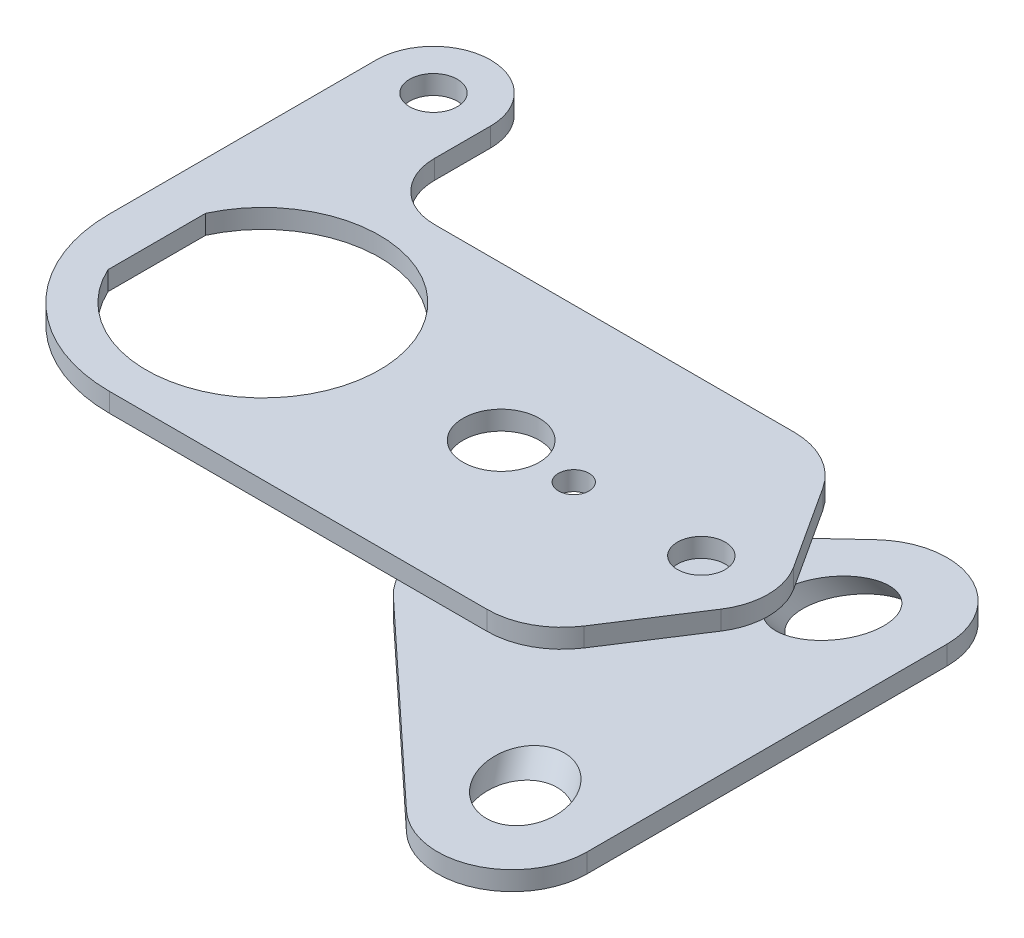
ISO-10303-21;
HEADER;
FILE_DESCRIPTION(('STEP AP214'),'2;1');
FILE_NAME('part.step','',(''),(''),'','','');
FILE_SCHEMA(('AUTOMOTIVE_DESIGN { 1 0 10303 214 1 1 1 1 }'));
ENDSEC;
DATA;
#1=APPLICATION_CONTEXT('core data for automotive mechanical design processes');
#2=APPLICATION_PROTOCOL_DEFINITION('international standard','automotive_design',2000,#1);
#3=PRODUCT_CONTEXT('',#1,'mechanical');
#4=PRODUCT('Part','Part','',(#3));
#5=PRODUCT_RELATED_PRODUCT_CATEGORY('part','',(#4));
#6=PRODUCT_DEFINITION_FORMATION('','',#4);
#7=PRODUCT_DEFINITION_CONTEXT('part definition',#1,'design');
#8=PRODUCT_DEFINITION('design','',#6,#7);
#9=PRODUCT_DEFINITION_SHAPE('','',#8);
#10=(LENGTH_UNIT() NAMED_UNIT(*) SI_UNIT(.MILLI.,.METRE.));
#11=(NAMED_UNIT(*) PLANE_ANGLE_UNIT() SI_UNIT($,.RADIAN.));
#12=(NAMED_UNIT(*) SI_UNIT($,.STERADIAN.) SOLID_ANGLE_UNIT());
#13=UNCERTAINTY_MEASURE_WITH_UNIT(LENGTH_MEASURE(1.E-05),#10,'distance_accuracy_value','');
#14=(GEOMETRIC_REPRESENTATION_CONTEXT(3) GLOBAL_UNCERTAINTY_ASSIGNED_CONTEXT((#13)) GLOBAL_UNIT_ASSIGNED_CONTEXT((#10,
#11,#12)) REPRESENTATION_CONTEXT('',''));
#15=CARTESIAN_POINT('',(0.,0.,0.));
#16=DIRECTION('',(0.,0.,1.));
#17=DIRECTION('',(1.,0.,0.));
#18=AXIS2_PLACEMENT_3D('',#15,#16,#17);
#19=CARTESIAN_POINT('',(0.,-22.225,0.));
#20=DIRECTION('',(0.,-1.,0.));
#21=DIRECTION('',(0.,0.,-1.));
#22=AXIS2_PLACEMENT_3D('',#19,#20,#21);
#23=PLANE('',#22);
#24=CARTESIAN_POINT('',(12.0901905923452,-22.225,0.));
#25=DIRECTION('',(0.,1.,0.));
#26=DIRECTION('',(0.,0.,1.));
#27=AXIS2_PLACEMENT_3D('',#24,#25,#26);
#28=CIRCLE('',#27,2.55269999999999);
#29=CARTESIAN_POINT('',(12.0901905923452,-22.225,2.55269999999999));
#30=VERTEX_POINT('',#29);
#31=EDGE_CURVE('E213',#30,#30,#28,.T.);
#32=ORIENTED_EDGE('',*,*,#31,.T.);
#33=EDGE_LOOP('',(#32));
#34=FACE_BOUND('',#33,.T.);
#35=CARTESIAN_POINT('',(30.8214622641509,-22.225,27.9909198113208));
#36=DIRECTION('',(0.,-1.,0.));
#37=DIRECTION('',(-0.453842868921282,0.,-0.891081730443005));
#38=AXIS2_PLACEMENT_3D('',#35,#36,#37);
#39=ELLIPSE('',#38,8.34330157224348,6.35);
#40=CARTESIAN_POINT('',(27.0349143423285,-22.225,20.5563562087182));
#41=VERTEX_POINT('',#40);
#42=EDGE_CURVE('E13',#41,#41,#39,.T.);
#43=ORIENTED_EDGE('',*,*,#42,.F.);
#44=EDGE_LOOP('',(#43));
#45=FACE_BOUND('',#44,.T.);
#46=CARTESIAN_POINT('',(30.8214622641509,-22.225,-27.9909198113208));
#47=DIRECTION('',(0.,1.,0.));
#48=DIRECTION('',(-0.453842868921282,0.,0.891081730443005));
#49=AXIS2_PLACEMENT_3D('',#46,#47,#48);
#50=ELLIPSE('',#49,8.34330157224348,6.35);
#51=CARTESIAN_POINT('',(27.0349143423285,-22.225,-20.5563562087182));
#52=VERTEX_POINT('',#51);
#53=EDGE_CURVE('E146',#52,#52,#50,.T.);
#54=ORIENTED_EDGE('',*,*,#53,.T.);
#55=EDGE_LOOP('',(#54));
#56=FACE_BOUND('',#55,.T.);
#57=CARTESIAN_POINT('',(0.,-22.225,0.));
#58=DIRECTION('',(0.,-1.,0.));
#59=DIRECTION('',(0.,0.,-1.));
#60=AXIS2_PLACEMENT_3D('',#57,#58,#59);
#61=CIRCLE('',#60,6.35);
#62=CARTESIAN_POINT('',(0.,-22.225,-6.35));
#63=VERTEX_POINT('',#62);
#64=EDGE_CURVE('E115',#63,#63,#61,.T.);
#65=ORIENTED_EDGE('',*,*,#64,.F.);
#66=EDGE_LOOP('',(#65));
#67=FACE_BOUND('',#66,.T.);
#68=DIRECTION('',(0.731631898404247,0.,-0.681699908491557));
#69=VECTOR('',#68,1.);
#70=CARTESIAN_POINT('',(-8.65758883784278,-22.225,-9.29172510973394));
#71=LINE('',#70,#69);
#72=CARTESIAN_POINT('',(-8.65758883784278,-22.225,-9.29172510973394));
#73=VERTEX_POINT('',#72);
#74=CARTESIAN_POINT('',(23.3291311537776,-22.225,-39.0954339676884));
#75=VERTEX_POINT('',#74);
#76=EDGE_CURVE('E198',#73,#75,#71,.T.);
#77=ORIENTED_EDGE('',*,*,#76,.T.);
#78=CARTESIAN_POINT('',(31.8302668874597,-22.225,-29.9716215717197));
#79=DIRECTION('',(0.,-1.,0.));
#80=DIRECTION('',(0.,0.,-1.));
#81=AXIS2_PLACEMENT_3D('',#78,#79,#80);
#82=CIRCLE('',#81,12.4704956356722);
#83=CARTESIAN_POINT('',(44.3007625231319,-22.225,-29.9716215717197));
#84=VERTEX_POINT('',#83);
#85=EDGE_CURVE('E66',#75,#84,#82,.T.);
#86=ORIENTED_EDGE('',*,*,#85,.T.);
#87=DIRECTION('',(0.,0.,-1.));
#88=VECTOR('',#87,1.);
#89=CARTESIAN_POINT('',(44.3007625231319,-22.225,0.));
#90=LINE('',#89,#88);
#91=CARTESIAN_POINT('',(44.3007625231319,-22.225,29.9716215717197));
#92=VERTEX_POINT('',#91);
#93=EDGE_CURVE('E116',#92,#84,#90,.T.);
#94=ORIENTED_EDGE('',*,*,#93,.F.);
#95=CARTESIAN_POINT('',(31.8302668874597,-22.225,29.9716215717197));
#96=DIRECTION('',(0.,-1.,0.));
#97=DIRECTION('',(0.,0.,-1.));
#98=AXIS2_PLACEMENT_3D('',#95,#96,#97);
#99=CIRCLE('',#98,12.4704956356722);
#100=CARTESIAN_POINT('',(23.3291311537776,-22.225,39.0954339676884));
#101=VERTEX_POINT('',#100);
#102=EDGE_CURVE('E123',#92,#101,#99,.T.);
#103=ORIENTED_EDGE('',*,*,#102,.T.);
#104=DIRECTION('',(-0.731631898404247,0.,-0.681699908491558));
#105=VECTOR('',#104,1.);
#106=CARTESIAN_POINT('',(-8.65758883784278,-22.225,9.29172510973393));
#107=LINE('',#106,#105);
#108=CARTESIAN_POINT('',(-8.65758883784278,-22.225,9.29172510973393));
#109=VERTEX_POINT('',#108);
#110=EDGE_CURVE('E138',#101,#109,#107,.T.);
#111=ORIENTED_EDGE('',*,*,#110,.T.);
#112=CARTESIAN_POINT('',(0.,-22.225,0.));
#113=DIRECTION('',(0.,-1.,0.));
#114=DIRECTION('',(0.,0.,-1.));
#115=AXIS2_PLACEMENT_3D('',#112,#113,#114);
#116=CIRCLE('',#115,12.7);
#117=EDGE_CURVE('E142',#109,#73,#116,.T.);
#118=ORIENTED_EDGE('',*,*,#117,.T.);
#119=EDGE_LOOP('',(#77,#86,#94,#103,#111,#118));
#120=FACE_BOUND('',#119,.T.);
#121=ADVANCED_FACE('F49',(#34,#45,#56,#67,#120),#23,.T.);
#122=CARTESIAN_POINT('',(0.,-19.05,0.));
#123=DIRECTION('',(0.,-1.,0.));
#124=DIRECTION('',(0.,0.,-1.));
#125=AXIS2_PLACEMENT_3D('',#122,#123,#124);
#126=PLANE('',#125);
#127=CARTESIAN_POINT('',(12.0901905923452,-19.05,0.));
#128=DIRECTION('',(0.,-1.,0.));
#129=DIRECTION('',(0.,0.,-1.));
#130=AXIS2_PLACEMENT_3D('',#127,#128,#129);
#131=CIRCLE('',#130,2.5527);
#132=CARTESIAN_POINT('',(12.0901905923452,-19.05,-2.5527));
#133=VERTEX_POINT('',#132);
#134=EDGE_CURVE('E53',#133,#133,#131,.T.);
#135=ORIENTED_EDGE('',*,*,#134,.T.);
#136=EDGE_LOOP('',(#135));
#137=FACE_BOUND('',#136,.T.);
#138=CARTESIAN_POINT('',(29.5933962264151,-19.05,25.5797169811321));
#139=DIRECTION('',(0.,-1.,0.));
#140=DIRECTION('',(-0.453842868921282,0.,-0.891081730443005));
#141=AXIS2_PLACEMENT_3D('',#138,#139,#140);
#142=ELLIPSE('',#141,8.34330157224348,6.35);
#143=CARTESIAN_POINT('',(25.8068483045927,-19.05,18.1451533785295));
#144=VERTEX_POINT('',#143);
#145=EDGE_CURVE('E58',#144,#144,#142,.T.);
#146=ORIENTED_EDGE('',*,*,#145,.T.);
#147=EDGE_LOOP('',(#146));
#148=FACE_BOUND('',#147,.T.);
#149=CARTESIAN_POINT('',(29.5933962264151,-19.05,-25.5797169811321));
#150=DIRECTION('',(0.,1.,0.));
#151=DIRECTION('',(-0.453842868921282,0.,0.891081730443005));
#152=AXIS2_PLACEMENT_3D('',#149,#150,#151);
#153=ELLIPSE('',#152,8.34330157224348,6.35);
#154=CARTESIAN_POINT('',(25.8068483045927,-19.05,-18.1451533785295));
#155=VERTEX_POINT('',#154);
#156=EDGE_CURVE('E149',#155,#155,#153,.T.);
#157=ORIENTED_EDGE('',*,*,#156,.F.);
#158=EDGE_LOOP('',(#157));
#159=FACE_BOUND('',#158,.T.);
#160=CARTESIAN_POINT('',(0.,-19.05,0.));
#161=DIRECTION('',(0.,-1.,0.));
#162=DIRECTION('',(0.,0.,-1.));
#163=AXIS2_PLACEMENT_3D('',#160,#161,#162);
#164=CIRCLE('',#163,6.35);
#165=CARTESIAN_POINT('',(0.,-19.05,-6.35));
#166=VERTEX_POINT('',#165);
#167=EDGE_CURVE('E145',#166,#166,#164,.T.);
#168=ORIENTED_EDGE('',*,*,#167,.T.);
#169=EDGE_LOOP('',(#168));
#170=FACE_BOUND('',#169,.T.);
#171=CARTESIAN_POINT('',(31.8302668874597,-19.05,-29.9716215717197));
#172=DIRECTION('',(0.,-1.,0.));
#173=DIRECTION('',(0.,0.,-1.));
#174=AXIS2_PLACEMENT_3D('',#171,#172,#173);
#175=CIRCLE('',#174,12.4704956356722);
#176=CARTESIAN_POINT('',(44.3007625231319,-19.05,-29.9716215717197));
#177=VERTEX_POINT('',#176);
#178=CARTESIAN_POINT('',(23.3291311537776,-19.05,-39.0954339676884));
#179=VERTEX_POINT('',#178);
#180=EDGE_CURVE('E211',#177,#179,#175,.F.);
#181=ORIENTED_EDGE('',*,*,#180,.T.);
#182=DIRECTION('',(-0.731631898404247,0.,0.681699908491557));
#183=VECTOR('',#182,1.);
#184=CARTESIAN_POINT('',(-8.65758883784278,-19.05,-9.29172510973394));
#185=LINE('',#184,#183);
#186=CARTESIAN_POINT('',(-8.65758883784278,-19.05,-9.29172510973394));
#187=VERTEX_POINT('',#186);
#188=EDGE_CURVE('E139',#179,#187,#185,.T.);
#189=ORIENTED_EDGE('',*,*,#188,.T.);
#190=CARTESIAN_POINT('',(0.,-19.05,0.));
#191=DIRECTION('',(0.,-1.,0.));
#192=DIRECTION('',(0.,0.,-1.));
#193=AXIS2_PLACEMENT_3D('',#190,#191,#192);
#194=CIRCLE('',#193,12.7);
#195=CARTESIAN_POINT('',(-8.65758883784278,-19.05,9.29172510973393));
#196=VERTEX_POINT('',#195);
#197=EDGE_CURVE('E135',#187,#196,#194,.F.);
#198=ORIENTED_EDGE('',*,*,#197,.T.);
#199=DIRECTION('',(0.731631898404247,0.,0.681699908491558));
#200=VECTOR('',#199,1.);
#201=CARTESIAN_POINT('',(-8.65758883784278,-19.05,9.29172510973393));
#202=LINE('',#201,#200);
#203=CARTESIAN_POINT('',(23.3291311537776,-19.05,39.0954339676884));
#204=VERTEX_POINT('',#203);
#205=EDGE_CURVE('E128',#196,#204,#202,.T.);
#206=ORIENTED_EDGE('',*,*,#205,.T.);
#207=CARTESIAN_POINT('',(31.8302668874597,-19.05,29.9716215717197));
#208=DIRECTION('',(0.,-1.,0.));
#209=DIRECTION('',(0.,0.,-1.));
#210=AXIS2_PLACEMENT_3D('',#207,#208,#209);
#211=CIRCLE('',#210,12.4704956356722);
#212=CARTESIAN_POINT('',(44.3007625231319,-19.05,29.9716215717197));
#213=VERTEX_POINT('',#212);
#214=EDGE_CURVE('E120',#204,#213,#211,.F.);
#215=ORIENTED_EDGE('',*,*,#214,.T.);
#216=DIRECTION('',(0.,0.,1.));
#217=VECTOR('',#216,1.);
#218=CARTESIAN_POINT('',(44.3007625231319,-19.05,0.));
#219=LINE('',#218,#217);
#220=EDGE_CURVE('E105',#177,#213,#219,.T.);
#221=ORIENTED_EDGE('',*,*,#220,.F.);
#222=EDGE_LOOP('',(#181,#189,#198,#206,#215,#221));
#223=FACE_BOUND('',#222,.T.);
#224=ADVANCED_FACE('F51',(#137,#148,#159,#170,#223),#126,.F.);
#225=CARTESIAN_POINT('',(36.7090218974339,-37.4464956372682,39.5506405547178));
#226=DIRECTION('',(-0.294383710597585,0.761089593252292,-0.577997285441599));
#227=DIRECTION('',(0.,0.604797490267115,0.796379303954214));
#228=AXIS2_PLACEMENT_3D('',#225,#226,#227);
#229=CYLINDRICAL_SURFACE('',#228,6.35);
#230=ORIENTED_EDGE('',*,*,#42,.T.);
#231=EDGE_LOOP('',(#230));
#232=FACE_BOUND('',#231,.T.);
#233=ORIENTED_EDGE('',*,*,#145,.F.);
#234=EDGE_LOOP('',(#233));
#235=FACE_BOUND('',#234,.T.);
#236=ADVANCED_FACE('F168',(#232,#235),#229,.F.);
#237=CARTESIAN_POINT('',(36.7090218974339,-37.4464956372682,-39.5506405547178));
#238=DIRECTION('',(-0.294383710597585,0.761089593252292,0.577997285441599));
#239=DIRECTION('',(0.,0.604797490267115,-0.796379303954214));
#240=AXIS2_PLACEMENT_3D('',#237,#238,#239);
#241=CYLINDRICAL_SURFACE('',#240,6.35);
#242=ORIENTED_EDGE('',*,*,#53,.F.);
#243=EDGE_LOOP('',(#242));
#244=FACE_BOUND('',#243,.T.);
#245=ORIENTED_EDGE('',*,*,#156,.T.);
#246=EDGE_LOOP('',(#245));
#247=FACE_BOUND('',#246,.T.);
#248=ADVANCED_FACE('F160',(#244,#247),#241,.F.);
#249=CARTESIAN_POINT('',(0.,24.3105122421383,0.));
#250=DIRECTION('',(0.,-1.,0.));
#251=DIRECTION('',(0.,0.,-1.));
#252=AXIS2_PLACEMENT_3D('',#249,#250,#251);
#253=CYLINDRICAL_SURFACE('',#252,6.35);
#254=ORIENTED_EDGE('',*,*,#64,.T.);
#255=EDGE_LOOP('',(#254));
#256=FACE_BOUND('',#255,.T.);
#257=ORIENTED_EDGE('',*,*,#167,.F.);
#258=EDGE_LOOP('',(#257));
#259=FACE_BOUND('',#258,.T.);
#260=ADVANCED_FACE('F157',(#256,#259),#253,.F.);
#261=CARTESIAN_POINT('',(31.8302668874597,104.244697777317,-29.9716215717197));
#262=DIRECTION('',(0.,-1.,0.));
#263=DIRECTION('',(0.,0.,-1.));
#264=AXIS2_PLACEMENT_3D('',#261,#262,#263);
#265=CYLINDRICAL_SURFACE('',#264,12.4704956356722);
#266=DIRECTION('',(0.,-1.,0.));
#267=VECTOR('',#266,1.);
#268=CARTESIAN_POINT('',(44.3007625231319,104.244697777317,-29.9716215717197));
#269=LINE('',#268,#267);
#270=EDGE_CURVE('E111',#177,#84,#269,.T.);
#271=ORIENTED_EDGE('',*,*,#270,.T.);
#272=ORIENTED_EDGE('',*,*,#85,.F.);
#273=DIRECTION('',(0.,-1.,0.));
#274=VECTOR('',#273,1.);
#275=CARTESIAN_POINT('',(23.3291311537776,104.244697777317,-39.0954339676884));
#276=LINE('',#275,#274);
#277=EDGE_CURVE('E207',#179,#75,#276,.T.);
#278=ORIENTED_EDGE('',*,*,#277,.F.);
#279=ORIENTED_EDGE('',*,*,#180,.F.);
#280=EDGE_LOOP('',(#271,#272,#278,#279));
#281=FACE_BOUND('',#280,.T.);
#282=ADVANCED_FACE('F159',(#281),#265,.T.);
#283=CARTESIAN_POINT('',(44.3007625231319,104.244697777317,0.));
#284=DIRECTION('',(-1.,0.,0.));
#285=DIRECTION('',(0.,0.,1.));
#286=AXIS2_PLACEMENT_3D('',#283,#284,#285);
#287=PLANE('',#286);
#288=ORIENTED_EDGE('',*,*,#220,.T.);
#289=DIRECTION('',(0.,-1.,0.));
#290=VECTOR('',#289,1.);
#291=CARTESIAN_POINT('',(44.3007625231319,104.244697777317,29.9716215717197));
#292=LINE('',#291,#290);
#293=EDGE_CURVE('E109',#213,#92,#292,.T.);
#294=ORIENTED_EDGE('',*,*,#293,.T.);
#295=ORIENTED_EDGE('',*,*,#93,.T.);
#296=ORIENTED_EDGE('',*,*,#270,.F.);
#297=EDGE_LOOP('',(#288,#294,#295,#296));
#298=FACE_BOUND('',#297,.T.);
#299=ADVANCED_FACE('F107',(#298),#287,.F.);
#300=CARTESIAN_POINT('',(31.8302668874597,104.244697777317,29.9716215717197));
#301=DIRECTION('',(0.,-1.,0.));
#302=DIRECTION('',(0.,0.,-1.));
#303=AXIS2_PLACEMENT_3D('',#300,#301,#302);
#304=CYLINDRICAL_SURFACE('',#303,12.4704956356722);
#305=DIRECTION('',(0.,-1.,0.));
#306=VECTOR('',#305,1.);
#307=CARTESIAN_POINT('',(23.3291311537776,104.244697777317,39.0954339676884));
#308=LINE('',#307,#306);
#309=EDGE_CURVE('E134',#204,#101,#308,.T.);
#310=ORIENTED_EDGE('',*,*,#309,.T.);
#311=ORIENTED_EDGE('',*,*,#102,.F.);
#312=ORIENTED_EDGE('',*,*,#293,.F.);
#313=ORIENTED_EDGE('',*,*,#214,.F.);
#314=EDGE_LOOP('',(#310,#311,#312,#313));
#315=FACE_BOUND('',#314,.T.);
#316=ADVANCED_FACE('F119',(#315),#304,.T.);
#317=CARTESIAN_POINT('',(-8.65758883784278,104.244697777317,9.29172510973393));
#318=DIRECTION('',(-0.681699908491558,0.,0.731631898404247));
#319=DIRECTION('',(0.731631898404247,0.,0.681699908491558));
#320=AXIS2_PLACEMENT_3D('',#317,#318,#319);
#321=PLANE('',#320);
#322=DIRECTION('',(0.,-1.,0.));
#323=VECTOR('',#322,1.);
#324=CARTESIAN_POINT('',(-8.65758883784278,104.244697777317,9.29172510973393));
#325=LINE('',#324,#323);
#326=EDGE_CURVE('E137',#196,#109,#325,.T.);
#327=ORIENTED_EDGE('',*,*,#326,.T.);
#328=ORIENTED_EDGE('',*,*,#110,.F.);
#329=ORIENTED_EDGE('',*,*,#309,.F.);
#330=ORIENTED_EDGE('',*,*,#205,.F.);
#331=EDGE_LOOP('',(#327,#328,#329,#330));
#332=FACE_BOUND('',#331,.T.);
#333=ADVANCED_FACE('F220',(#332),#321,.T.);
#334=CARTESIAN_POINT('',(0.,104.244697777317,0.));
#335=DIRECTION('',(0.,-1.,0.));
#336=DIRECTION('',(0.,0.,-1.));
#337=AXIS2_PLACEMENT_3D('',#334,#335,#336);
#338=CYLINDRICAL_SURFACE('',#337,12.7);
#339=DIRECTION('',(0.,-1.,0.));
#340=VECTOR('',#339,1.);
#341=CARTESIAN_POINT('',(-8.65758883784278,104.244697777317,-9.29172510973394));
#342=LINE('',#341,#340);
#343=EDGE_CURVE('E74',#187,#73,#342,.T.);
#344=ORIENTED_EDGE('',*,*,#343,.T.);
#345=ORIENTED_EDGE('',*,*,#117,.F.);
#346=ORIENTED_EDGE('',*,*,#326,.F.);
#347=ORIENTED_EDGE('',*,*,#197,.F.);
#348=EDGE_LOOP('',(#344,#345,#346,#347));
#349=FACE_BOUND('',#348,.T.);
#350=ADVANCED_FACE('F223',(#349),#338,.T.);
#351=CARTESIAN_POINT('',(-8.65758883784278,104.244697777317,-9.29172510973394));
#352=DIRECTION('',(-0.681699908491557,0.,-0.731631898404247));
#353=DIRECTION('',(-0.731631898404247,0.,0.681699908491557));
#354=AXIS2_PLACEMENT_3D('',#351,#352,#353);
#355=PLANE('',#354);
#356=ORIENTED_EDGE('',*,*,#277,.T.);
#357=ORIENTED_EDGE('',*,*,#76,.F.);
#358=ORIENTED_EDGE('',*,*,#343,.F.);
#359=ORIENTED_EDGE('',*,*,#188,.F.);
#360=EDGE_LOOP('',(#356,#357,#358,#359));
#361=FACE_BOUND('',#360,.T.);
#362=ADVANCED_FACE('F224',(#361),#355,.T.);
#363=CARTESIAN_POINT('',(12.0901905923452,3.175,0.));
#364=DIRECTION('',(0.,1.,0.));
#365=DIRECTION('',(0.,0.,1.));
#366=AXIS2_PLACEMENT_3D('',#363,#364,#365);
#367=CYLINDRICAL_SURFACE('',#366,2.5527);
#368=ORIENTED_EDGE('',*,*,#31,.F.);
#369=EDGE_LOOP('',(#368));
#370=FACE_BOUND('',#369,.T.);
#371=ORIENTED_EDGE('',*,*,#134,.F.);
#372=EDGE_LOOP('',(#371));
#373=FACE_BOUND('',#372,.T.);
#374=ADVANCED_FACE('F226',(#370,#373),#367,.F.);
#375=CLOSED_SHELL('',(#121,#224,#236,#248,#260,#282,#299,#316,#333,#350,#362,#374));
#376=MANIFOLD_SOLID_BREP('B2',#375);
#377=CARTESIAN_POINT('',(23.2338046233088,3.175,13.0932017603989));
#378=DIRECTION('',(0.,-1.,0.));
#379=DIRECTION('',(0.,0.,-1.));
#380=AXIS2_PLACEMENT_3D('',#377,#378,#379);
#381=CYLINDRICAL_SURFACE('',#380,12.4704956356722);
#382=CARTESIAN_POINT('',(23.2338046233088,0.,13.0932017603989));
#383=DIRECTION('',(0.,-1.,0.));
#384=DIRECTION('',(0.,0.,-1.));
#385=AXIS2_PLACEMENT_3D('',#382,#383,#384);
#386=CIRCLE('',#385,12.4704956356722);
#387=CARTESIAN_POINT('',(33.6987802315256,0.,19.8753508975638));
#388=VERTEX_POINT('',#387);
#389=CARTESIAN_POINT('',(23.2338046233088,0.,25.5636973960711));
#390=VERTEX_POINT('',#389);
#391=EDGE_CURVE('E342',#388,#390,#386,.T.);
#392=ORIENTED_EDGE('',*,*,#391,.F.);
#393=DIRECTION('',(0.,1.,0.));
#394=VECTOR('',#393,1.);
#395=CARTESIAN_POINT('',(33.6987802315256,-41.1789633152074,19.8753508975638));
#396=LINE('',#395,#394);
#397=CARTESIAN_POINT('',(33.6987802315256,3.175,19.8753508975638));
#398=VERTEX_POINT('',#397);
#399=EDGE_CURVE('E337',#388,#398,#396,.T.);
#400=ORIENTED_EDGE('',*,*,#399,.T.);
#401=CARTESIAN_POINT('',(23.2338046233088,3.175,13.0932017603989));
#402=DIRECTION('',(0.,-1.,0.));
#403=DIRECTION('',(0.,0.,-1.));
#404=AXIS2_PLACEMENT_3D('',#401,#402,#403);
#405=CIRCLE('',#404,12.4704956356722);
#406=CARTESIAN_POINT('',(23.2338046233088,3.175,25.5636973960711));
#407=VERTEX_POINT('',#406);
#408=EDGE_CURVE('E444',#398,#407,#405,.T.);
#409=ORIENTED_EDGE('',*,*,#408,.T.);
#410=DIRECTION('',(0.,-1.,0.));
#411=VECTOR('',#410,1.);
#412=CARTESIAN_POINT('',(23.2338046233088,3.175,25.5636973960711));
#413=LINE('',#412,#411);
#414=EDGE_CURVE('E509',#407,#390,#413,.T.);
#415=ORIENTED_EDGE('',*,*,#414,.T.);
#416=EDGE_LOOP('',(#392,#400,#409,#415));
#417=FACE_BOUND('',#416,.T.);
#418=ADVANCED_FACE('F322',(#417),#381,.T.);
#419=CARTESIAN_POINT('',(-39.6875,3.175,0.));
#420=DIRECTION('',(0.,-1.,0.));
#421=DIRECTION('',(0.,0.,-1.));
#422=AXIS2_PLACEMENT_3D('',#419,#420,#421);
#423=CYLINDRICAL_SURFACE('',#422,25.5636973960711);
#424=DIRECTION('',(0.,1.,0.));
#425=VECTOR('',#424,1.);
#426=CARTESIAN_POINT('',(-65.2511973960711,-57.2381264979908,0.));
#427=LINE('',#426,#425);
#428=CARTESIAN_POINT('',(-65.2511973960711,0.,0.));
#429=VERTEX_POINT('',#428);
#430=CARTESIAN_POINT('',(-65.2511973960711,3.175,0.));
#431=VERTEX_POINT('',#430);
#432=EDGE_CURVE('E466',#429,#431,#427,.T.);
#433=ORIENTED_EDGE('',*,*,#432,.F.);
#434=CARTESIAN_POINT('',(-39.6875,0.,0.));
#435=DIRECTION('',(0.,-1.,0.));
#436=DIRECTION('',(0.,0.,-1.));
#437=AXIS2_PLACEMENT_3D('',#434,#435,#436);
#438=CIRCLE('',#437,25.5636973960711);
#439=CARTESIAN_POINT('',(-39.6875,0.,25.5636973960711));
#440=VERTEX_POINT('',#439);
#441=EDGE_CURVE('E504',#440,#429,#438,.T.);
#442=ORIENTED_EDGE('',*,*,#441,.F.);
#443=DIRECTION('',(0.,-1.,0.));
#444=VECTOR('',#443,1.);
#445=CARTESIAN_POINT('',(-39.6875,3.175,25.5636973960711));
#446=LINE('',#445,#444);
#447=CARTESIAN_POINT('',(-39.6875,3.175,25.5636973960711));
#448=VERTEX_POINT('',#447);
#449=EDGE_CURVE('E512',#448,#440,#446,.T.);
#450=ORIENTED_EDGE('',*,*,#449,.F.);
#451=CARTESIAN_POINT('',(-39.6875,3.175,0.));
#452=DIRECTION('',(0.,-1.,0.));
#453=DIRECTION('',(0.,0.,-1.));
#454=AXIS2_PLACEMENT_3D('',#451,#452,#453);
#455=CIRCLE('',#454,25.5636973960711);
#456=EDGE_CURVE('E491',#448,#431,#455,.T.);
#457=ORIENTED_EDGE('',*,*,#456,.T.);
#458=EDGE_LOOP('',(#433,#442,#450,#457));
#459=FACE_BOUND('',#458,.T.);
#460=ADVANCED_FACE('F599',(#459),#423,.T.);
#461=CARTESIAN_POINT('',(0.,3.175,0.));
#462=DIRECTION('',(0.,1.,0.));
#463=DIRECTION('',(0.,0.,1.));
#464=AXIS2_PLACEMENT_3D('',#461,#462,#463);
#465=PLANE('',#464);
#466=ORIENTED_EDGE('',*,*,#408,.F.);
#467=DIRECTION('',(0.543855620121812,0.,-0.839178803630025));
#468=VECTOR('',#467,1.);
#469=CARTESIAN_POINT('',(33.6987802315256,3.175,19.8753508975638));
#470=LINE('',#469,#468);
#471=CARTESIAN_POINT('',(42.6628744553386,3.175,6.04359557860364));
#472=VERTEX_POINT('',#471);
#473=EDGE_CURVE('E426',#398,#472,#470,.T.);
#474=ORIENTED_EDGE('',*,*,#473,.T.);
#475=CARTESIAN_POINT('',(33.3375,3.175,0.));
#476=DIRECTION('',(0.,1.,0.));
#477=DIRECTION('',(0.,0.,1.));
#478=AXIS2_PLACEMENT_3D('',#475,#476,#477);
#479=CIRCLE('',#478,11.1125);
#480=CARTESIAN_POINT('',(42.6628744553387,3.175,-6.04359557860364));
#481=VERTEX_POINT('',#480);
#482=EDGE_CURVE('E433',#472,#481,#479,.T.);
#483=ORIENTED_EDGE('',*,*,#482,.T.);
#484=DIRECTION('',(-0.543855620121812,0.,-0.839178803630025));
#485=VECTOR('',#484,1.);
#486=CARTESIAN_POINT('',(33.6987802315256,3.175,-19.8753508975638));
#487=LINE('',#486,#485);
#488=CARTESIAN_POINT('',(33.6987802315256,3.175,-19.8753508975638));
#489=VERTEX_POINT('',#488);
#490=EDGE_CURVE('E439',#481,#489,#487,.T.);
#491=ORIENTED_EDGE('',*,*,#490,.T.);
#492=CARTESIAN_POINT('',(23.2338046233088,3.175,-13.0932017603989));
#493=DIRECTION('',(0.,-1.,0.));
#494=DIRECTION('',(0.,0.,-1.));
#495=AXIS2_PLACEMENT_3D('',#492,#493,#494);
#496=CIRCLE('',#495,12.4704956356722);
#497=CARTESIAN_POINT('',(23.2338046233088,3.175,-25.5636973960711));
#498=VERTEX_POINT('',#497);
#499=EDGE_CURVE('E485',#498,#489,#496,.T.);
#500=ORIENTED_EDGE('',*,*,#499,.F.);
#501=DIRECTION('',(-1.,0.,0.));
#502=VECTOR('',#501,1.);
#503=CARTESIAN_POINT('',(0.,3.175,-25.5636973960711));
#504=LINE('',#503,#502);
#505=CARTESIAN_POINT('',(-36.6761973960711,3.175,-25.5636973960711));
#506=VERTEX_POINT('',#505);
#507=EDGE_CURVE('E488',#498,#506,#504,.T.);
#508=ORIENTED_EDGE('',*,*,#507,.T.);
#509=CARTESIAN_POINT('',(-36.6761973960711,3.175,-35.0886973960711));
#510=DIRECTION('',(0.,1.,0.));
#511=DIRECTION('',(0.,0.,1.));
#512=AXIS2_PLACEMENT_3D('',#509,#510,#511);
#513=CIRCLE('',#512,9.525);
#514=CARTESIAN_POINT('',(-46.2011973960711,3.175,-35.0886973960711));
#515=VERTEX_POINT('',#514);
#516=EDGE_CURVE('E330',#506,#515,#513,.F.);
#517=ORIENTED_EDGE('',*,*,#516,.T.);
#518=DIRECTION('',(0.,0.,-1.));
#519=VECTOR('',#518,1.);
#520=CARTESIAN_POINT('',(-46.2011973960711,3.175,-44.45));
#521=LINE('',#520,#519);
#522=CARTESIAN_POINT('',(-46.2011973960711,3.175,-44.45));
#523=VERTEX_POINT('',#522);
#524=EDGE_CURVE('E462',#515,#523,#521,.T.);
#525=ORIENTED_EDGE('',*,*,#524,.T.);
#526=CARTESIAN_POINT('',(-55.7261973960711,3.175,-44.45));
#527=DIRECTION('',(0.,1.,0.));
#528=DIRECTION('',(0.,0.,1.));
#529=AXIS2_PLACEMENT_3D('',#526,#527,#528);
#530=CIRCLE('',#529,9.52500000000001);
#531=CARTESIAN_POINT('',(-65.2511973960711,3.175,-44.45));
#532=VERTEX_POINT('',#531);
#533=EDGE_CURVE('E470',#523,#532,#530,.T.);
#534=ORIENTED_EDGE('',*,*,#533,.T.);
#535=DIRECTION('',(0.,0.,1.));
#536=VECTOR('',#535,1.);
#537=CARTESIAN_POINT('',(-65.2511973960711,3.175,0.));
#538=LINE('',#537,#536);
#539=EDGE_CURVE('E473',#532,#431,#538,.T.);
#540=ORIENTED_EDGE('',*,*,#539,.T.);
#541=ORIENTED_EDGE('',*,*,#456,.F.);
#542=DIRECTION('',(1.,0.,0.));
#543=VECTOR('',#542,1.);
#544=CARTESIAN_POINT('',(0.,3.175,25.5636973960711));
#545=LINE('',#544,#543);
#546=EDGE_CURVE('E494',#448,#407,#545,.T.);
#547=ORIENTED_EDGE('',*,*,#546,.T.);
#548=EDGE_LOOP('',(#466,#474,#483,#491,#500,#508,#517,#525,#534,#540,#541,#547));
#549=FACE_BOUND('',#548,.T.);
#550=CARTESIAN_POINT('',(-55.7261973960711,3.175,-44.45));
#551=DIRECTION('',(0.,1.,0.));
#552=DIRECTION('',(0.,0.,1.));
#553=AXIS2_PLACEMENT_3D('',#550,#551,#552);
#554=CIRCLE('',#553,3.96875);
#555=CARTESIAN_POINT('',(-55.7261973960711,3.175,-40.48125));
#556=VERTEX_POINT('',#555);
#557=EDGE_CURVE('E456',#556,#556,#554,.T.);
#558=ORIENTED_EDGE('',*,*,#557,.F.);
#559=EDGE_LOOP('',(#558));
#560=FACE_BOUND('',#559,.T.);
#561=CARTESIAN_POINT('',(33.3375,3.175,0.));
#562=DIRECTION('',(0.,1.,0.));
#563=DIRECTION('',(0.,0.,1.));
#564=AXIS2_PLACEMENT_3D('',#561,#562,#563);
#565=CIRCLE('',#564,3.96875);
#566=CARTESIAN_POINT('',(33.3375,3.175,3.96875));
#567=VERTEX_POINT('',#566);
#568=EDGE_CURVE('E546',#567,#567,#565,.T.);
#569=ORIENTED_EDGE('',*,*,#568,.F.);
#570=EDGE_LOOP('',(#569));
#571=FACE_BOUND('',#570,.T.);
#572=CARTESIAN_POINT('',(-39.6875,3.175,0.));
#573=DIRECTION('',(0.,1.,0.));
#574=DIRECTION('',(0.,0.,1.));
#575=AXIS2_PLACEMENT_3D('',#572,#573,#574);
#576=CIRCLE('',#575,19.431);
#577=CARTESIAN_POINT('',(-57.3405,3.175,8.12005862047804));
#578=VERTEX_POINT('',#577);
#579=CARTESIAN_POINT('',(-57.3405,3.175,-8.12005862047804));
#580=VERTEX_POINT('',#579);
#581=EDGE_CURVE('E511',#578,#580,#576,.T.);
#582=ORIENTED_EDGE('',*,*,#581,.F.);
#583=DIRECTION('',(0.,0.,1.));
#584=VECTOR('',#583,1.);
#585=CARTESIAN_POINT('',(-57.3405,3.175,8.12005862047804));
#586=LINE('',#585,#584);
#587=EDGE_CURVE('E516',#580,#578,#586,.T.);
#588=ORIENTED_EDGE('',*,*,#587,.F.);
#589=EDGE_LOOP('',(#582,#588));
#590=FACE_BOUND('',#589,.T.);
#591=CARTESIAN_POINT('',(12.0901905923452,3.175,0.));
#592=DIRECTION('',(0.,1.,0.));
#593=DIRECTION('',(0.,0.,1.));
#594=AXIS2_PLACEMENT_3D('',#591,#592,#593);
#595=CIRCLE('',#594,2.5527);
#596=CARTESIAN_POINT('',(12.0901905923452,3.175,2.5527));
#597=VERTEX_POINT('',#596);
#598=EDGE_CURVE('E522',#597,#597,#595,.T.);
#599=ORIENTED_EDGE('',*,*,#598,.F.);
#600=EDGE_LOOP('',(#599));
#601=FACE_BOUND('',#600,.T.);
#602=CARTESIAN_POINT('',(0.,3.175,0.));
#603=DIRECTION('',(0.,1.,0.));
#604=DIRECTION('',(0.,0.,1.));
#605=AXIS2_PLACEMENT_3D('',#602,#603,#604);
#606=CIRCLE('',#605,6.35);
#607=CARTESIAN_POINT('',(0.,3.175,6.35));
#608=VERTEX_POINT('',#607);
#609=EDGE_CURVE('E528',#608,#608,#606,.F.);
#610=ORIENTED_EDGE('',*,*,#609,.T.);
#611=EDGE_LOOP('',(#610));
#612=FACE_BOUND('',#611,.T.);
#613=ADVANCED_FACE('F441',(#549,#560,#571,#590,#601,#612),#465,.T.);
#614=CARTESIAN_POINT('',(0.,0.,0.));
#615=DIRECTION('',(0.,1.,0.));
#616=DIRECTION('',(0.,0.,1.));
#617=AXIS2_PLACEMENT_3D('',#614,#615,#616);
#618=PLANE('',#617);
#619=DIRECTION('',(-0.543855620121812,0.,0.839178803630025));
#620=VECTOR('',#619,1.);
#621=CARTESIAN_POINT('',(33.6987802315256,0.,19.8753508975638));
#622=LINE('',#621,#620);
#623=CARTESIAN_POINT('',(42.6628744553386,0.,6.04359557860364));
#624=VERTEX_POINT('',#623);
#625=EDGE_CURVE('E427',#624,#388,#622,.T.);
#626=ORIENTED_EDGE('',*,*,#625,.T.);
#627=ORIENTED_EDGE('',*,*,#391,.T.);
#628=DIRECTION('',(1.,0.,0.));
#629=VECTOR('',#628,1.);
#630=CARTESIAN_POINT('',(0.,0.,25.5636973960711));
#631=LINE('',#630,#629);
#632=EDGE_CURVE('E486',#440,#390,#631,.T.);
#633=ORIENTED_EDGE('',*,*,#632,.F.);
#634=ORIENTED_EDGE('',*,*,#441,.T.);
#635=DIRECTION('',(0.,0.,-1.));
#636=VECTOR('',#635,1.);
#637=CARTESIAN_POINT('',(-65.2511973960711,0.,0.));
#638=LINE('',#637,#636);
#639=CARTESIAN_POINT('',(-65.2511973960711,0.,-44.45));
#640=VERTEX_POINT('',#639);
#641=EDGE_CURVE('E465',#429,#640,#638,.T.);
#642=ORIENTED_EDGE('',*,*,#641,.T.);
#643=CARTESIAN_POINT('',(-55.7261973960711,0.,-44.45));
#644=DIRECTION('',(0.,1.,0.));
#645=DIRECTION('',(0.,0.,1.));
#646=AXIS2_PLACEMENT_3D('',#643,#644,#645);
#647=CIRCLE('',#646,9.52500000000001);
#648=CARTESIAN_POINT('',(-46.2011973960711,0.,-44.45));
#649=VERTEX_POINT('',#648);
#650=EDGE_CURVE('E463',#640,#649,#647,.F.);
#651=ORIENTED_EDGE('',*,*,#650,.T.);
#652=DIRECTION('',(0.,0.,1.));
#653=VECTOR('',#652,1.);
#654=CARTESIAN_POINT('',(-46.2011973960711,0.,-44.45));
#655=LINE('',#654,#653);
#656=CARTESIAN_POINT('',(-46.2011973960711,0.,-35.0886973960711));
#657=VERTEX_POINT('',#656);
#658=EDGE_CURVE('E468',#649,#657,#655,.T.);
#659=ORIENTED_EDGE('',*,*,#658,.T.);
#660=CARTESIAN_POINT('',(-36.6761973960711,0.,-35.0886973960711));
#661=DIRECTION('',(0.,1.,0.));
#662=DIRECTION('',(0.,0.,1.));
#663=AXIS2_PLACEMENT_3D('',#660,#661,#662);
#664=CIRCLE('',#663,9.525);
#665=CARTESIAN_POINT('',(-36.6761973960711,0.,-25.5636973960711));
#666=VERTEX_POINT('',#665);
#667=EDGE_CURVE('E47',#657,#666,#664,.T.);
#668=ORIENTED_EDGE('',*,*,#667,.T.);
#669=DIRECTION('',(-1.,0.,0.));
#670=VECTOR('',#669,1.);
#671=CARTESIAN_POINT('',(0.,0.,-25.5636973960711));
#672=LINE('',#671,#670);
#673=CARTESIAN_POINT('',(23.2338046233088,0.,-25.5636973960711));
#674=VERTEX_POINT('',#673);
#675=EDGE_CURVE('E501',#674,#666,#672,.T.);
#676=ORIENTED_EDGE('',*,*,#675,.F.);
#677=CARTESIAN_POINT('',(23.2338046233088,0.,-13.0932017603989));
#678=DIRECTION('',(0.,-1.,0.));
#679=DIRECTION('',(0.,0.,-1.));
#680=AXIS2_PLACEMENT_3D('',#677,#678,#679);
#681=CIRCLE('',#680,12.4704956356722);
#682=CARTESIAN_POINT('',(33.6987802315256,0.,-19.8753508975638));
#683=VERTEX_POINT('',#682);
#684=EDGE_CURVE('E498',#674,#683,#681,.T.);
#685=ORIENTED_EDGE('',*,*,#684,.T.);
#686=DIRECTION('',(0.543855620121812,0.,0.839178803630025));
#687=VECTOR('',#686,1.);
#688=CARTESIAN_POINT('',(33.6987802315256,0.,-19.8753508975638));
#689=LINE('',#688,#687);
#690=CARTESIAN_POINT('',(42.6628744553386,0.,-6.04359557860364));
#691=VERTEX_POINT('',#690);
#692=EDGE_CURVE('E447',#683,#691,#689,.T.);
#693=ORIENTED_EDGE('',*,*,#692,.T.);
#694=CARTESIAN_POINT('',(33.3375,0.,0.));
#695=DIRECTION('',(0.,1.,0.));
#696=DIRECTION('',(0.,0.,1.));
#697=AXIS2_PLACEMENT_3D('',#694,#695,#696);
#698=CIRCLE('',#697,11.1125);
#699=EDGE_CURVE('E588',#691,#624,#698,.F.);
#700=ORIENTED_EDGE('',*,*,#699,.T.);
#701=EDGE_LOOP('',(#626,#627,#633,#634,#642,#651,#659,#668,#676,#685,#693,#700));
#702=FACE_BOUND('',#701,.T.);
#703=CARTESIAN_POINT('',(-55.7261973960711,0.,-44.45));
#704=DIRECTION('',(0.,1.,0.));
#705=DIRECTION('',(0.,0.,1.));
#706=AXIS2_PLACEMENT_3D('',#703,#704,#705);
#707=CIRCLE('',#706,3.96875);
#708=CARTESIAN_POINT('',(-55.7261973960711,0.,-40.48125));
#709=VERTEX_POINT('',#708);
#710=EDGE_CURVE('E459',#709,#709,#707,.T.);
#711=ORIENTED_EDGE('',*,*,#710,.T.);
#712=EDGE_LOOP('',(#711));
#713=FACE_BOUND('',#712,.T.);
#714=DIRECTION('',(0.,0.,1.));
#715=VECTOR('',#714,1.);
#716=CARTESIAN_POINT('',(-57.3405,0.,0.));
#717=LINE('',#716,#715);
#718=CARTESIAN_POINT('',(-57.3405,0.,-8.12005862047804));
#719=VERTEX_POINT('',#718);
#720=CARTESIAN_POINT('',(-57.3405,0.,8.12005862047804));
#721=VERTEX_POINT('',#720);
#722=EDGE_CURVE('E545',#719,#721,#717,.T.);
#723=ORIENTED_EDGE('',*,*,#722,.T.);
#724=CARTESIAN_POINT('',(-39.6875,0.,0.));
#725=DIRECTION('',(0.,1.,0.));
#726=DIRECTION('',(0.,0.,1.));
#727=AXIS2_PLACEMENT_3D('',#724,#725,#726);
#728=CIRCLE('',#727,19.431);
#729=EDGE_CURVE('E557',#721,#719,#728,.T.);
#730=ORIENTED_EDGE('',*,*,#729,.T.);
#731=EDGE_LOOP('',(#723,#730));
#732=FACE_BOUND('',#731,.T.);
#733=CARTESIAN_POINT('',(12.0901905923452,0.,0.));
#734=DIRECTION('',(0.,1.,0.));
#735=DIRECTION('',(0.,0.,1.));
#736=AXIS2_PLACEMENT_3D('',#733,#734,#735);
#737=CIRCLE('',#736,2.5527);
#738=CARTESIAN_POINT('',(12.0901905923452,0.,2.5527));
#739=VERTEX_POINT('',#738);
#740=EDGE_CURVE('E527',#739,#739,#737,.T.);
#741=ORIENTED_EDGE('',*,*,#740,.T.);
#742=EDGE_LOOP('',(#741));
#743=FACE_BOUND('',#742,.T.);
#744=CARTESIAN_POINT('',(0.,0.,0.));
#745=DIRECTION('',(0.,1.,0.));
#746=DIRECTION('',(0.,0.,1.));
#747=AXIS2_PLACEMENT_3D('',#744,#745,#746);
#748=CIRCLE('',#747,6.35);
#749=CARTESIAN_POINT('',(0.,0.,6.35));
#750=VERTEX_POINT('',#749);
#751=EDGE_CURVE('E531',#750,#750,#748,.T.);
#752=ORIENTED_EDGE('',*,*,#751,.T.);
#753=EDGE_LOOP('',(#752));
#754=FACE_BOUND('',#753,.T.);
#755=CARTESIAN_POINT('',(22.225,0.,-11.1125));
#756=DIRECTION('',(0.,-1.,0.));
#757=DIRECTION('',(-0.453842868921282,0.,0.891081730443005));
#758=AXIS2_PLACEMENT_3D('',#755,#756,#757);
#759=ELLIPSE('',#758,8.34330157224348,6.35);
#760=CARTESIAN_POINT('',(18.4384520781776,0.,-3.67793639739743));
#761=VERTEX_POINT('',#760);
#762=EDGE_CURVE('E532',#761,#761,#759,.T.);
#763=ORIENTED_EDGE('',*,*,#762,.F.);
#764=EDGE_LOOP('',(#763));
#765=FACE_BOUND('',#764,.T.);
#766=CARTESIAN_POINT('',(22.225,0.,11.1125));
#767=DIRECTION('',(0.,1.,0.));
#768=DIRECTION('',(-0.453842868921282,0.,-0.891081730443005));
#769=AXIS2_PLACEMENT_3D('',#766,#767,#768);
#770=ELLIPSE('',#769,8.34330157224348,6.35);
#771=CARTESIAN_POINT('',(18.4384520781776,0.,3.67793639739743));
#772=VERTEX_POINT('',#771);
#773=EDGE_CURVE('E541',#772,#772,#770,.T.);
#774=ORIENTED_EDGE('',*,*,#773,.T.);
#775=EDGE_LOOP('',(#774));
#776=FACE_BOUND('',#775,.T.);
#777=CARTESIAN_POINT('',(33.3375,0.,0.));
#778=DIRECTION('',(0.,1.,0.));
#779=DIRECTION('',(0.,0.,1.));
#780=AXIS2_PLACEMENT_3D('',#777,#778,#779);
#781=CIRCLE('',#780,3.96875);
#782=CARTESIAN_POINT('',(33.3375,0.,3.96875));
#783=VERTEX_POINT('',#782);
#784=EDGE_CURVE('E542',#783,#783,#781,.T.);
#785=ORIENTED_EDGE('',*,*,#784,.T.);
#786=EDGE_LOOP('',(#785));
#787=FACE_BOUND('',#786,.T.);
#788=ADVANCED_FACE('F578',(#702,#713,#732,#743,#754,#765,#776,#787),#618,.F.);
#789=CARTESIAN_POINT('',(33.3375,0.,0.));
#790=DIRECTION('',(0.,1.,0.));
#791=DIRECTION('',(0.,0.,1.));
#792=AXIS2_PLACEMENT_3D('',#789,#790,#791);
#793=CYLINDRICAL_SURFACE('',#792,3.96875);
#794=ORIENTED_EDGE('',*,*,#784,.F.);
#795=EDGE_LOOP('',(#794));
#796=FACE_BOUND('',#795,.T.);
#797=ORIENTED_EDGE('',*,*,#568,.T.);
#798=EDGE_LOOP('',(#797));
#799=FACE_BOUND('',#798,.T.);
#800=ADVANCED_FACE('F655',(#796,#799),#793,.F.);
#801=CARTESIAN_POINT('',(36.7090218974339,-37.4464956372682,39.5506405547178));
#802=DIRECTION('',(-0.294383710597585,0.761089593252292,-0.577997285441599));
#803=DIRECTION('',(0.,0.604797490267115,0.796379303954214));
#804=AXIS2_PLACEMENT_3D('',#801,#802,#803);
#805=CYLINDRICAL_SURFACE('',#804,6.35);
#806=CARTESIAN_POINT('',(21.3039504716981,2.38125,9.30409787735849));
#807=DIRECTION('',(0.,1.,0.));
#808=DIRECTION('',(0.453842868921282,0.,0.891081730443005));
#809=AXIS2_PLACEMENT_3D('',#806,#807,#808);
#810=ELLIPSE('',#809,8.34330157224348,6.35);
#811=CARTESIAN_POINT('',(25.0904983935205,2.38125,16.7386614799611));
#812=VERTEX_POINT('',#811);
#813=EDGE_CURVE('E538',#812,#812,#810,.T.);
#814=ORIENTED_EDGE('',*,*,#813,.T.);
#815=EDGE_LOOP('',(#814));
#816=FACE_BOUND('',#815,.T.);
#817=ORIENTED_EDGE('',*,*,#773,.F.);
#818=EDGE_LOOP('',(#817));
#819=FACE_BOUND('',#818,.T.);
#820=ADVANCED_FACE('F651',(#816,#819),#805,.F.);
#821=CARTESIAN_POINT('',(0.,2.38125,0.));
#822=DIRECTION('',(0.,1.,0.));
#823=DIRECTION('',(0.,0.,1.));
#824=AXIS2_PLACEMENT_3D('',#821,#822,#823);
#825=PLANE('',#824);
#826=ORIENTED_EDGE('',*,*,#813,.F.);
#827=EDGE_LOOP('',(#826));
#828=FACE_BOUND('',#827,.T.);
#829=ADVANCED_FACE('F647',(#828),#825,.F.);
#830=CARTESIAN_POINT('',(36.7090218974339,-37.4464956372682,-39.5506405547178));
#831=DIRECTION('',(-0.294383710597585,0.761089593252292,0.577997285441599));
#832=DIRECTION('',(0.,0.604797490267115,-0.796379303954214));
#833=AXIS2_PLACEMENT_3D('',#830,#831,#832);
#834=CYLINDRICAL_SURFACE('',#833,6.35);
#835=CARTESIAN_POINT('',(21.3039504716981,2.38125,-9.30409787735849));
#836=DIRECTION('',(0.,-1.,0.));
#837=DIRECTION('',(0.453842868921282,0.,-0.891081730443005));
#838=AXIS2_PLACEMENT_3D('',#835,#836,#837);
#839=ELLIPSE('',#838,8.34330157224348,6.35);
#840=CARTESIAN_POINT('',(25.0904983935205,2.38125,-16.7386614799611));
#841=VERTEX_POINT('',#840);
#842=EDGE_CURVE('E535',#841,#841,#839,.T.);
#843=ORIENTED_EDGE('',*,*,#842,.F.);
#844=EDGE_LOOP('',(#843));
#845=FACE_BOUND('',#844,.T.);
#846=ORIENTED_EDGE('',*,*,#762,.T.);
#847=EDGE_LOOP('',(#846));
#848=FACE_BOUND('',#847,.T.);
#849=ADVANCED_FACE('F643',(#845,#848),#834,.F.);
#850=CARTESIAN_POINT('',(0.,2.38125,0.));
#851=DIRECTION('',(0.,1.,0.));
#852=DIRECTION('',(0.,0.,-1.));
#853=AXIS2_PLACEMENT_3D('',#850,#851,#852);
#854=PLANE('',#853);
#855=ORIENTED_EDGE('',*,*,#842,.T.);
#856=EDGE_LOOP('',(#855));
#857=FACE_BOUND('',#856,.T.);
#858=ADVANCED_FACE('F639',(#857),#854,.F.);
#859=CARTESIAN_POINT('',(0.,24.3105122421383,0.));
#860=DIRECTION('',(0.,-1.,0.));
#861=DIRECTION('',(0.,0.,-1.));
#862=AXIS2_PLACEMENT_3D('',#859,#860,#861);
#863=CYLINDRICAL_SURFACE('',#862,6.35);
#864=ORIENTED_EDGE('',*,*,#609,.F.);
#865=EDGE_LOOP('',(#864));
#866=FACE_BOUND('',#865,.T.);
#867=ORIENTED_EDGE('',*,*,#751,.F.);
#868=EDGE_LOOP('',(#867));
#869=FACE_BOUND('',#868,.T.);
#870=ADVANCED_FACE('F635',(#866,#869),#863,.F.);
#871=CARTESIAN_POINT('',(12.0901905923452,3.175,0.));
#872=DIRECTION('',(0.,1.,0.));
#873=DIRECTION('',(0.,0.,1.));
#874=AXIS2_PLACEMENT_3D('',#871,#872,#873);
#875=CYLINDRICAL_SURFACE('',#874,2.5527);
#876=ORIENTED_EDGE('',*,*,#598,.T.);
#877=EDGE_LOOP('',(#876));
#878=FACE_BOUND('',#877,.T.);
#879=ORIENTED_EDGE('',*,*,#740,.F.);
#880=EDGE_LOOP('',(#879));
#881=FACE_BOUND('',#880,.T.);
#882=ADVANCED_FACE('F631',(#878,#881),#875,.F.);
#883=CARTESIAN_POINT('',(-39.6875,-22.225,0.));
#884=DIRECTION('',(0.,1.,0.));
#885=DIRECTION('',(0.,0.,1.));
#886=AXIS2_PLACEMENT_3D('',#883,#884,#885);
#887=CYLINDRICAL_SURFACE('',#886,19.431);
#888=DIRECTION('',(0.,1.,0.));
#889=VECTOR('',#888,1.);
#890=CARTESIAN_POINT('',(-57.3405,-22.225,8.12005862047804));
#891=LINE('',#890,#889);
#892=EDGE_CURVE('E520',#721,#578,#891,.T.);
#893=ORIENTED_EDGE('',*,*,#892,.T.);
#894=ORIENTED_EDGE('',*,*,#581,.T.);
#895=DIRECTION('',(0.,1.,0.));
#896=VECTOR('',#895,1.);
#897=CARTESIAN_POINT('',(-57.3405,-22.225,-8.12005862047804));
#898=LINE('',#897,#896);
#899=EDGE_CURVE('E519',#719,#580,#898,.T.);
#900=ORIENTED_EDGE('',*,*,#899,.F.);
#901=ORIENTED_EDGE('',*,*,#729,.F.);
#902=EDGE_LOOP('',(#893,#894,#900,#901));
#903=FACE_BOUND('',#902,.T.);
#904=ADVANCED_FACE('F627',(#903),#887,.F.);
#905=CARTESIAN_POINT('',(-57.3405,-22.225,8.12005862047804));
#906=DIRECTION('',(-1.,0.,0.));
#907=DIRECTION('',(0.,0.,1.));
#908=AXIS2_PLACEMENT_3D('',#905,#906,#907);
#909=PLANE('',#908);
#910=ORIENTED_EDGE('',*,*,#899,.T.);
#911=ORIENTED_EDGE('',*,*,#587,.T.);
#912=ORIENTED_EDGE('',*,*,#892,.F.);
#913=ORIENTED_EDGE('',*,*,#722,.F.);
#914=EDGE_LOOP('',(#910,#911,#912,#913));
#915=FACE_BOUND('',#914,.T.);
#916=ADVANCED_FACE('F624',(#915),#909,.F.);
#917=CARTESIAN_POINT('',(0.,3.175,25.5636973960711));
#918=DIRECTION('',(0.,0.,-1.));
#919=DIRECTION('',(-1.,0.,0.));
#920=AXIS2_PLACEMENT_3D('',#917,#918,#919);
#921=PLANE('',#920);
#922=ORIENTED_EDGE('',*,*,#632,.T.);
#923=ORIENTED_EDGE('',*,*,#414,.F.);
#924=ORIENTED_EDGE('',*,*,#546,.F.);
#925=ORIENTED_EDGE('',*,*,#449,.T.);
#926=EDGE_LOOP('',(#922,#923,#924,#925));
#927=FACE_BOUND('',#926,.T.);
#928=ADVANCED_FACE('F594',(#927),#921,.F.);
#929=CARTESIAN_POINT('',(0.,3.175,-25.5636973960711));
#930=DIRECTION('',(0.,0.,1.));
#931=DIRECTION('',(1.,0.,0.));
#932=AXIS2_PLACEMENT_3D('',#929,#930,#931);
#933=PLANE('',#932);
#934=ORIENTED_EDGE('',*,*,#675,.T.);
#935=DIRECTION('',(0.,1.,0.));
#936=VECTOR('',#935,1.);
#937=CARTESIAN_POINT('',(-36.6761973960711,3.175,-25.5636973960711));
#938=LINE('',#937,#936);
#939=EDGE_CURVE('E560',#666,#506,#938,.T.);
#940=ORIENTED_EDGE('',*,*,#939,.T.);
#941=ORIENTED_EDGE('',*,*,#507,.F.);
#942=DIRECTION('',(0.,-1.,0.));
#943=VECTOR('',#942,1.);
#944=CARTESIAN_POINT('',(23.2338046233088,3.175,-25.5636973960711));
#945=LINE('',#944,#943);
#946=EDGE_CURVE('E496',#498,#674,#945,.T.);
#947=ORIENTED_EDGE('',*,*,#946,.T.);
#948=EDGE_LOOP('',(#934,#940,#941,#947));
#949=FACE_BOUND('',#948,.T.);
#950=ADVANCED_FACE('F581',(#949),#933,.F.);
#951=CARTESIAN_POINT('',(23.2338046233088,3.175,-13.0932017603989));
#952=DIRECTION('',(0.,-1.,0.));
#953=DIRECTION('',(0.,0.,-1.));
#954=AXIS2_PLACEMENT_3D('',#951,#952,#953);
#955=CYLINDRICAL_SURFACE('',#954,12.4704956356722);
#956=DIRECTION('',(0.,1.,0.));
#957=VECTOR('',#956,1.);
#958=CARTESIAN_POINT('',(33.6987802315256,-41.1789633152074,-19.8753508975638));
#959=LINE('',#958,#957);
#960=EDGE_CURVE('E451',#683,#489,#959,.T.);
#961=ORIENTED_EDGE('',*,*,#960,.F.);
#962=ORIENTED_EDGE('',*,*,#684,.F.);
#963=ORIENTED_EDGE('',*,*,#946,.F.);
#964=ORIENTED_EDGE('',*,*,#499,.T.);
#965=EDGE_LOOP('',(#961,#962,#963,#964));
#966=FACE_BOUND('',#965,.T.);
#967=ADVANCED_FACE('F584',(#966),#955,.T.);
#968=CARTESIAN_POINT('',(-65.2511973960711,-57.2381264979908,0.));
#969=DIRECTION('',(-1.,0.,0.));
#970=DIRECTION('',(0.,0.,1.));
#971=AXIS2_PLACEMENT_3D('',#968,#969,#970);
#972=PLANE('',#971);
#973=ORIENTED_EDGE('',*,*,#641,.F.);
#974=ORIENTED_EDGE('',*,*,#432,.T.);
#975=ORIENTED_EDGE('',*,*,#539,.F.);
#976=DIRECTION('',(0.,1.,0.));
#977=VECTOR('',#976,1.);
#978=CARTESIAN_POINT('',(-65.2511973960711,-57.2381264979908,-44.45));
#979=LINE('',#978,#977);
#980=EDGE_CURVE('E478',#640,#532,#979,.T.);
#981=ORIENTED_EDGE('',*,*,#980,.F.);
#982=EDGE_LOOP('',(#973,#974,#975,#981));
#983=FACE_BOUND('',#982,.T.);
#984=ADVANCED_FACE('F606',(#983),#972,.T.);
#985=CARTESIAN_POINT('',(-55.7261973960711,-57.2381264979908,-44.45));
#986=DIRECTION('',(0.,1.,0.));
#987=DIRECTION('',(0.,0.,1.));
#988=AXIS2_PLACEMENT_3D('',#985,#986,#987);
#989=CYLINDRICAL_SURFACE('',#988,9.52500000000001);
#990=ORIENTED_EDGE('',*,*,#650,.F.);
#991=ORIENTED_EDGE('',*,*,#980,.T.);
#992=ORIENTED_EDGE('',*,*,#533,.F.);
#993=DIRECTION('',(0.,1.,0.));
#994=VECTOR('',#993,1.);
#995=CARTESIAN_POINT('',(-46.2011973960711,-57.2381264979908,-44.45));
#996=LINE('',#995,#994);
#997=EDGE_CURVE('E476',#649,#523,#996,.T.);
#998=ORIENTED_EDGE('',*,*,#997,.F.);
#999=EDGE_LOOP('',(#990,#991,#992,#998));
#1000=FACE_BOUND('',#999,.T.);
#1001=ADVANCED_FACE('F604',(#1000),#989,.T.);
#1002=CARTESIAN_POINT('',(-46.2011973960711,-57.2381264979908,-44.45));
#1003=DIRECTION('',(1.,0.,0.));
#1004=DIRECTION('',(0.,0.,-1.));
#1005=AXIS2_PLACEMENT_3D('',#1002,#1003,#1004);
#1006=PLANE('',#1005);
#1007=ORIENTED_EDGE('',*,*,#524,.F.);
#1008=DIRECTION('',(0.,1.,0.));
#1009=VECTOR('',#1008,1.);
#1010=CARTESIAN_POINT('',(-46.2011973960711,-57.2381264979908,-35.0886973960711));
#1011=LINE('',#1010,#1009);
#1012=EDGE_CURVE('E563',#515,#657,#1011,.F.);
#1013=ORIENTED_EDGE('',*,*,#1012,.T.);
#1014=ORIENTED_EDGE('',*,*,#658,.F.);
#1015=ORIENTED_EDGE('',*,*,#997,.T.);
#1016=EDGE_LOOP('',(#1007,#1013,#1014,#1015));
#1017=FACE_BOUND('',#1016,.T.);
#1018=ADVANCED_FACE('F571',(#1017),#1006,.T.);
#1019=CARTESIAN_POINT('',(-36.6761973960711,3.175,-35.0886973960711));
#1020=DIRECTION('',(0.,1.,0.));
#1021=DIRECTION('',(0.,0.,1.));
#1022=AXIS2_PLACEMENT_3D('',#1019,#1020,#1021);
#1023=CYLINDRICAL_SURFACE('',#1022,9.525);
#1024=ORIENTED_EDGE('',*,*,#667,.F.);
#1025=ORIENTED_EDGE('',*,*,#1012,.F.);
#1026=ORIENTED_EDGE('',*,*,#516,.F.);
#1027=ORIENTED_EDGE('',*,*,#939,.F.);
#1028=EDGE_LOOP('',(#1024,#1025,#1026,#1027));
#1029=FACE_BOUND('',#1028,.T.);
#1030=ADVANCED_FACE('F324',(#1029),#1023,.F.);
#1031=CARTESIAN_POINT('',(-55.7261973960711,3.175,-44.45));
#1032=DIRECTION('',(0.,1.,0.));
#1033=DIRECTION('',(0.,0.,1.));
#1034=AXIS2_PLACEMENT_3D('',#1031,#1032,#1033);
#1035=CYLINDRICAL_SURFACE('',#1034,3.96875);
#1036=ORIENTED_EDGE('',*,*,#557,.T.);
#1037=EDGE_LOOP('',(#1036));
#1038=FACE_BOUND('',#1037,.T.);
#1039=ORIENTED_EDGE('',*,*,#710,.F.);
#1040=EDGE_LOOP('',(#1039));
#1041=FACE_BOUND('',#1040,.T.);
#1042=ADVANCED_FACE('F731',(#1038,#1041),#1035,.F.);
#1043=CARTESIAN_POINT('',(33.6987802315256,-41.1789633152074,-19.8753508975638));
#1044=DIRECTION('',(0.839178803630024,0.,-0.543855620121812));
#1045=DIRECTION('',(-0.543855620121812,0.,-0.839178803630025));
#1046=AXIS2_PLACEMENT_3D('',#1043,#1044,#1045);
#1047=PLANE('',#1046);
#1048=ORIENTED_EDGE('',*,*,#692,.F.);
#1049=ORIENTED_EDGE('',*,*,#960,.T.);
#1050=ORIENTED_EDGE('',*,*,#490,.F.);
#1051=DIRECTION('',(0.,1.,0.));
#1052=VECTOR('',#1051,1.);
#1053=CARTESIAN_POINT('',(42.6628744553387,-41.1789633152074,-6.04359557860364));
#1054=LINE('',#1053,#1052);
#1055=EDGE_CURVE('E430',#691,#481,#1054,.T.);
#1056=ORIENTED_EDGE('',*,*,#1055,.F.);
#1057=EDGE_LOOP('',(#1048,#1049,#1050,#1056));
#1058=FACE_BOUND('',#1057,.T.);
#1059=ADVANCED_FACE('F587',(#1058),#1047,.T.);
#1060=CARTESIAN_POINT('',(33.3375,-41.1789633152074,0.));
#1061=DIRECTION('',(0.,1.,0.));
#1062=DIRECTION('',(0.,0.,1.));
#1063=AXIS2_PLACEMENT_3D('',#1060,#1061,#1062);
#1064=CYLINDRICAL_SURFACE('',#1063,11.1125);
#1065=ORIENTED_EDGE('',*,*,#699,.F.);
#1066=ORIENTED_EDGE('',*,*,#1055,.T.);
#1067=ORIENTED_EDGE('',*,*,#482,.F.);
#1068=DIRECTION('',(0.,1.,0.));
#1069=VECTOR('',#1068,1.);
#1070=CARTESIAN_POINT('',(42.6628744553386,-41.1789633152074,6.04359557860364));
#1071=LINE('',#1070,#1069);
#1072=EDGE_CURVE('E422',#624,#472,#1071,.T.);
#1073=ORIENTED_EDGE('',*,*,#1072,.F.);
#1074=EDGE_LOOP('',(#1065,#1066,#1067,#1073));
#1075=FACE_BOUND('',#1074,.T.);
#1076=ADVANCED_FACE('F434',(#1075),#1064,.T.);
#1077=CARTESIAN_POINT('',(33.6987802315256,-41.1789633152074,19.8753508975638));
#1078=DIRECTION('',(0.839178803630025,0.,0.543855620121812));
#1079=DIRECTION('',(0.543855620121812,0.,-0.839178803630025));
#1080=AXIS2_PLACEMENT_3D('',#1077,#1078,#1079);
#1081=PLANE('',#1080);
#1082=ORIENTED_EDGE('',*,*,#625,.F.);
#1083=ORIENTED_EDGE('',*,*,#1072,.T.);
#1084=ORIENTED_EDGE('',*,*,#473,.F.);
#1085=ORIENTED_EDGE('',*,*,#399,.F.);
#1086=EDGE_LOOP('',(#1082,#1083,#1084,#1085));
#1087=FACE_BOUND('',#1086,.T.);
#1088=ADVANCED_FACE('F424',(#1087),#1081,.T.);
#1089=CLOSED_SHELL('',(#418,#460,#613,#788,#800,#820,#829,#849,#858,#870,#882,#904,#916,#928,
#950,#967,#984,#1001,#1018,#1030,#1042,#1059,#1076,#1088));
#1090=MANIFOLD_SOLID_BREP('B7',#1089);
#1091=ADVANCED_BREP_SHAPE_REPRESENTATION('',(#18,#376,#1090),#14);
#1092=SHAPE_DEFINITION_REPRESENTATION(#9,#1091);
ENDSEC;
END-ISO-10303-21;
